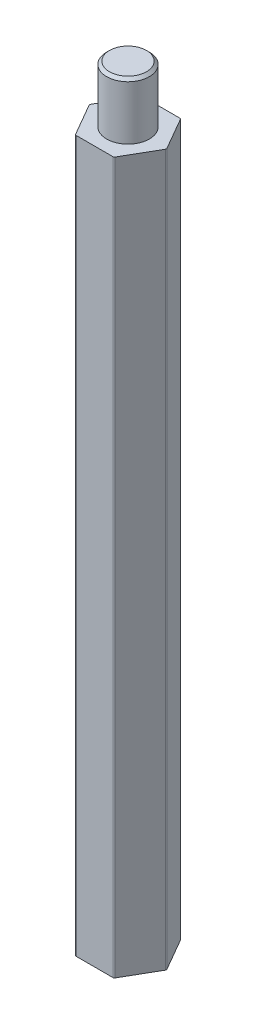
ISO-10303-21;
HEADER;
FILE_DESCRIPTION(('STEP AP214'),'2;1');
FILE_NAME('part.step','',(''),(''),'','','');
FILE_SCHEMA(('AUTOMOTIVE_DESIGN { 1 0 10303 214 1 1 1 1 }'));
ENDSEC;
DATA;
#1=APPLICATION_CONTEXT('core data for automotive mechanical design processes');
#2=APPLICATION_PROTOCOL_DEFINITION('international standard','automotive_design',2000,#1);
#3=PRODUCT_CONTEXT('',#1,'mechanical');
#4=PRODUCT('Part','Part','',(#3));
#5=PRODUCT_RELATED_PRODUCT_CATEGORY('part','',(#4));
#6=PRODUCT_DEFINITION_FORMATION('','',#4);
#7=PRODUCT_DEFINITION_CONTEXT('part definition',#1,'design');
#8=PRODUCT_DEFINITION('design','',#6,#7);
#9=PRODUCT_DEFINITION_SHAPE('','',#8);
#10=(LENGTH_UNIT() NAMED_UNIT(*) SI_UNIT(.MILLI.,.METRE.));
#11=(NAMED_UNIT(*) PLANE_ANGLE_UNIT() SI_UNIT($,.RADIAN.));
#12=(NAMED_UNIT(*) SI_UNIT($,.STERADIAN.) SOLID_ANGLE_UNIT());
#13=UNCERTAINTY_MEASURE_WITH_UNIT(LENGTH_MEASURE(1.E-05),#10,'distance_accuracy_value','');
#14=(GEOMETRIC_REPRESENTATION_CONTEXT(3) GLOBAL_UNCERTAINTY_ASSIGNED_CONTEXT((#13)) GLOBAL_UNIT_ASSIGNED_CONTEXT((#10,
#11,#12)) REPRESENTATION_CONTEXT('',''));
#15=CARTESIAN_POINT('',(0.,0.,0.));
#16=DIRECTION('',(0.,0.,1.));
#17=DIRECTION('',(1.,0.,0.));
#18=AXIS2_PLACEMENT_3D('',#15,#16,#17);
#19=CARTESIAN_POINT('',(1.35677313259565,50.,2.34999999999999));
#20=DIRECTION('',(-0.866025403784442,0.,-0.499999999999995));
#21=DIRECTION('',(-0.499999999999995,0.,0.866025403784442));
#22=AXIS2_PLACEMENT_3D('',#19,#20,#21);
#23=PLANE('',#22);
#24=DIRECTION('',(0.499999999999995,0.,-0.866025403784441));
#25=VECTOR('',#24,1.);
#26=CARTESIAN_POINT('',(1.35677313259565,50.,2.34999999999999));
#27=LINE('',#26,#25);
#28=CARTESIAN_POINT('',(1.38564064605513,50.,2.29999999999999));
#29=VERTEX_POINT('',#28);
#30=CARTESIAN_POINT('',(2.68467875173176,50.,0.0500000000000001));
#31=VERTEX_POINT('',#30);
#32=EDGE_CURVE('E145',#29,#31,#27,.T.);
#33=ORIENTED_EDGE('',*,*,#32,.F.);
#34=DIRECTION('',(0.,-1.,0.));
#35=VECTOR('',#34,1.);
#36=CARTESIAN_POINT('',(1.38564064605513,50.,2.29999999999999));
#37=LINE('',#36,#35);
#38=CARTESIAN_POINT('',(1.38564064605513,0.,2.29999999999999));
#39=VERTEX_POINT('',#38);
#40=EDGE_CURVE('E130',#29,#39,#37,.T.);
#41=ORIENTED_EDGE('',*,*,#40,.T.);
#42=DIRECTION('',(0.499999999999995,0.,-0.866025403784441));
#43=VECTOR('',#42,1.);
#44=CARTESIAN_POINT('',(1.35677313259565,0.,2.34999999999999));
#45=LINE('',#44,#43);
#46=CARTESIAN_POINT('',(2.68467875173176,0.,0.0500000000000001));
#47=VERTEX_POINT('',#46);
#48=EDGE_CURVE('E142',#39,#47,#45,.T.);
#49=ORIENTED_EDGE('',*,*,#48,.T.);
#50=DIRECTION('',(0.,-1.,0.));
#51=VECTOR('',#50,1.);
#52=CARTESIAN_POINT('',(2.68467875173176,50.,0.0499999999999997));
#53=LINE('',#52,#51);
#54=EDGE_CURVE('E147',#47,#31,#53,.F.);
#55=ORIENTED_EDGE('',*,*,#54,.T.);
#56=EDGE_LOOP('',(#33,#41,#49,#55));
#57=FACE_BOUND('',#56,.T.);
#58=ADVANCED_FACE('F36',(#57),#23,.F.);
#59=CARTESIAN_POINT('',(2.71354626519124,50.,0.));
#60=DIRECTION('',(-0.866025403784438,0.,0.500000000000001));
#61=DIRECTION('',(0.500000000000001,0.,0.866025403784438));
#62=AXIS2_PLACEMENT_3D('',#59,#60,#61);
#63=PLANE('',#62);
#64=DIRECTION('',(-0.500000000000001,0.,-0.866025403784438));
#65=VECTOR('',#64,1.);
#66=CARTESIAN_POINT('',(2.71354626519124,0.,0.));
#67=LINE('',#66,#65);
#68=CARTESIAN_POINT('',(2.68467875173176,0.,-0.0499999999999997));
#69=VERTEX_POINT('',#68);
#70=CARTESIAN_POINT('',(1.3856406460551,0.,-2.30000000000001));
#71=VERTEX_POINT('',#70);
#72=EDGE_CURVE('E151',#69,#71,#67,.T.);
#73=ORIENTED_EDGE('',*,*,#72,.T.);
#74=DIRECTION('',(0.,-1.,0.));
#75=VECTOR('',#74,1.);
#76=CARTESIAN_POINT('',(1.3856406460551,50.,-2.30000000000001));
#77=LINE('',#76,#75);
#78=CARTESIAN_POINT('',(1.3856406460551,50.,-2.30000000000001));
#79=VERTEX_POINT('',#78);
#80=EDGE_CURVE('E11',#71,#79,#77,.F.);
#81=ORIENTED_EDGE('',*,*,#80,.T.);
#82=DIRECTION('',(-0.500000000000001,0.,-0.866025403784438));
#83=VECTOR('',#82,1.);
#84=CARTESIAN_POINT('',(2.71354626519124,50.,0.));
#85=LINE('',#84,#83);
#86=CARTESIAN_POINT('',(2.68467875173176,50.,-0.0499999999999997));
#87=VERTEX_POINT('',#86);
#88=EDGE_CURVE('E228',#87,#79,#85,.T.);
#89=ORIENTED_EDGE('',*,*,#88,.F.);
#90=DIRECTION('',(0.,-1.,0.));
#91=VECTOR('',#90,1.);
#92=CARTESIAN_POINT('',(2.68467875173176,50.,-0.0499999999999997));
#93=LINE('',#92,#91);
#94=EDGE_CURVE('E44',#87,#69,#93,.T.);
#95=ORIENTED_EDGE('',*,*,#94,.T.);
#96=EDGE_LOOP('',(#73,#81,#89,#95));
#97=FACE_BOUND('',#96,.T.);
#98=ADVANCED_FACE('F225',(#97),#63,.F.);
#99=CARTESIAN_POINT('',(1.35677313259562,50.,-2.35000000000001));
#100=DIRECTION('',(0.,0.,1.));
#101=DIRECTION('',(1.,0.,0.));
#102=AXIS2_PLACEMENT_3D('',#99,#100,#101);
#103=PLANE('',#102);
#104=DIRECTION('',(-1.,0.,0.));
#105=VECTOR('',#104,1.);
#106=CARTESIAN_POINT('',(1.35677313259562,0.,-2.35000000000001));
#107=LINE('',#106,#105);
#108=CARTESIAN_POINT('',(1.29903810567665,0.,-2.35000000000001));
#109=VERTEX_POINT('',#108);
#110=CARTESIAN_POINT('',(-1.29903810567667,0.,-2.35));
#111=VERTEX_POINT('',#110);
#112=EDGE_CURVE('E155',#109,#111,#107,.T.);
#113=ORIENTED_EDGE('',*,*,#112,.T.);
#114=DIRECTION('',(0.,-1.,0.));
#115=VECTOR('',#114,1.);
#116=CARTESIAN_POINT('',(-1.29903810567667,50.,-2.35));
#117=LINE('',#116,#115);
#118=CARTESIAN_POINT('',(-1.29903810567667,50.,-2.35));
#119=VERTEX_POINT('',#118);
#120=EDGE_CURVE('E220',#111,#119,#117,.F.);
#121=ORIENTED_EDGE('',*,*,#120,.T.);
#122=DIRECTION('',(-1.,0.,0.));
#123=VECTOR('',#122,1.);
#124=CARTESIAN_POINT('',(1.35677313259562,50.,-2.35000000000001));
#125=LINE('',#124,#123);
#126=CARTESIAN_POINT('',(1.29903810567665,50.,-2.35000000000001));
#127=VERTEX_POINT('',#126);
#128=EDGE_CURVE('E241',#127,#119,#125,.T.);
#129=ORIENTED_EDGE('',*,*,#128,.F.);
#130=DIRECTION('',(0.,-1.,0.));
#131=VECTOR('',#130,1.);
#132=CARTESIAN_POINT('',(1.29903810567665,50.,-2.35000000000001));
#133=LINE('',#132,#131);
#134=EDGE_CURVE('E217',#127,#109,#133,.T.);
#135=ORIENTED_EDGE('',*,*,#134,.T.);
#136=EDGE_LOOP('',(#113,#121,#129,#135));
#137=FACE_BOUND('',#136,.T.);
#138=ADVANCED_FACE('F238',(#137),#103,.F.);
#139=CARTESIAN_POINT('',(-1.35677313259563,50.,-2.35));
#140=DIRECTION('',(0.866025403784441,0.,0.499999999999995));
#141=DIRECTION('',(0.499999999999995,0.,-0.866025403784442));
#142=AXIS2_PLACEMENT_3D('',#139,#140,#141);
#143=PLANE('',#142);
#144=DIRECTION('',(-0.499999999999995,0.,0.866025403784441));
#145=VECTOR('',#144,1.);
#146=CARTESIAN_POINT('',(-1.35677313259563,0.,-2.35));
#147=LINE('',#146,#145);
#148=CARTESIAN_POINT('',(-1.38564064605511,0.,-2.3));
#149=VERTEX_POINT('',#148);
#150=CARTESIAN_POINT('',(-2.68467875173176,0.,-0.0499999999999819));
#151=VERTEX_POINT('',#150);
#152=EDGE_CURVE('E166',#149,#151,#147,.T.);
#153=ORIENTED_EDGE('',*,*,#152,.T.);
#154=DIRECTION('',(0.,-1.,0.));
#155=VECTOR('',#154,1.);
#156=CARTESIAN_POINT('',(-2.68467875173176,50.,-0.0499999999999806));
#157=LINE('',#156,#155);
#158=CARTESIAN_POINT('',(-2.68467875173176,50.,-0.0499999999999819));
#159=VERTEX_POINT('',#158);
#160=EDGE_CURVE('E215',#151,#159,#157,.F.);
#161=ORIENTED_EDGE('',*,*,#160,.T.);
#162=DIRECTION('',(-0.499999999999995,0.,0.866025403784441));
#163=VECTOR('',#162,1.);
#164=CARTESIAN_POINT('',(-1.35677313259563,50.,-2.35));
#165=LINE('',#164,#163);
#166=CARTESIAN_POINT('',(-1.38564064605511,50.,-2.3));
#167=VERTEX_POINT('',#166);
#168=EDGE_CURVE('E243',#167,#159,#165,.T.);
#169=ORIENTED_EDGE('',*,*,#168,.F.);
#170=DIRECTION('',(0.,-1.,0.));
#171=VECTOR('',#170,1.);
#172=CARTESIAN_POINT('',(-1.38564064605511,50.,-2.3));
#173=LINE('',#172,#171);
#174=EDGE_CURVE('E212',#167,#149,#173,.T.);
#175=ORIENTED_EDGE('',*,*,#174,.T.);
#176=EDGE_LOOP('',(#153,#161,#169,#175));
#177=FACE_BOUND('',#176,.T.);
#178=ADVANCED_FACE('F266',(#177),#143,.F.);
#179=CARTESIAN_POINT('',(-2.71354626519124,50.,0.));
#180=DIRECTION('',(0.866025403784435,0.,-0.500000000000007));
#181=DIRECTION('',(-0.500000000000007,0.,-0.866025403784435));
#182=AXIS2_PLACEMENT_3D('',#179,#180,#181);
#183=PLANE('',#182);
#184=DIRECTION('',(0.500000000000007,0.,0.866025403784435));
#185=VECTOR('',#184,1.);
#186=CARTESIAN_POINT('',(-2.71354626519124,0.,0.));
#187=LINE('',#186,#185);
#188=CARTESIAN_POINT('',(-2.68467875173176,0.,0.0500000000000189));
#189=VERTEX_POINT('',#188);
#190=CARTESIAN_POINT('',(-1.38564064605508,0.,2.30000000000001));
#191=VERTEX_POINT('',#190);
#192=EDGE_CURVE('E169',#189,#191,#187,.T.);
#193=ORIENTED_EDGE('',*,*,#192,.T.);
#194=DIRECTION('',(0.,-1.,0.));
#195=VECTOR('',#194,1.);
#196=CARTESIAN_POINT('',(-1.38564064605508,50.,2.30000000000001));
#197=LINE('',#196,#195);
#198=CARTESIAN_POINT('',(-1.38564064605508,50.,2.30000000000001));
#199=VERTEX_POINT('',#198);
#200=EDGE_CURVE('E51',#191,#199,#197,.F.);
#201=ORIENTED_EDGE('',*,*,#200,.T.);
#202=DIRECTION('',(0.500000000000007,0.,0.866025403784435));
#203=VECTOR('',#202,1.);
#204=CARTESIAN_POINT('',(-2.71354626519124,50.,0.));
#205=LINE('',#204,#203);
#206=CARTESIAN_POINT('',(-2.68467875173176,50.,0.0500000000000189));
#207=VERTEX_POINT('',#206);
#208=EDGE_CURVE('E245',#207,#199,#205,.T.);
#209=ORIENTED_EDGE('',*,*,#208,.F.);
#210=DIRECTION('',(0.,-1.,0.));
#211=VECTOR('',#210,1.);
#212=CARTESIAN_POINT('',(-2.68467875173176,50.,0.0500000000000189));
#213=LINE('',#212,#211);
#214=EDGE_CURVE('E208',#207,#189,#213,.T.);
#215=ORIENTED_EDGE('',*,*,#214,.T.);
#216=EDGE_LOOP('',(#193,#201,#209,#215));
#217=FACE_BOUND('',#216,.T.);
#218=ADVANCED_FACE('F259',(#217),#183,.F.);
#219=CARTESIAN_POINT('',(-1.3567731325956,50.,2.35000000000001));
#220=DIRECTION('',(0.,0.,-1.));
#221=DIRECTION('',(-1.,0.,0.));
#222=AXIS2_PLACEMENT_3D('',#219,#220,#221);
#223=PLANE('',#222);
#224=DIRECTION('',(1.,0.,0.));
#225=VECTOR('',#224,1.);
#226=CARTESIAN_POINT('',(-1.3567731325956,0.,2.35000000000001));
#227=LINE('',#226,#225);
#228=CARTESIAN_POINT('',(-1.29903810567664,0.,2.35000000000001));
#229=VERTEX_POINT('',#228);
#230=CARTESIAN_POINT('',(1.29903810567669,0.,2.34999999999999));
#231=VERTEX_POINT('',#230);
#232=EDGE_CURVE('E171',#229,#231,#227,.T.);
#233=ORIENTED_EDGE('',*,*,#232,.T.);
#234=DIRECTION('',(0.,-1.,0.));
#235=VECTOR('',#234,1.);
#236=CARTESIAN_POINT('',(1.29903810567669,50.,2.34999999999999));
#237=LINE('',#236,#235);
#238=CARTESIAN_POINT('',(1.29903810567669,50.,2.34999999999999));
#239=VERTEX_POINT('',#238);
#240=EDGE_CURVE('E131',#231,#239,#237,.F.);
#241=ORIENTED_EDGE('',*,*,#240,.T.);
#242=DIRECTION('',(1.,0.,0.));
#243=VECTOR('',#242,1.);
#244=CARTESIAN_POINT('',(-1.3567731325956,50.,2.35000000000001));
#245=LINE('',#244,#243);
#246=CARTESIAN_POINT('',(-1.29903810567664,50.,2.35000000000001));
#247=VERTEX_POINT('',#246);
#248=EDGE_CURVE('E161',#247,#239,#245,.T.);
#249=ORIENTED_EDGE('',*,*,#248,.F.);
#250=DIRECTION('',(0.,-1.,0.));
#251=VECTOR('',#250,1.);
#252=CARTESIAN_POINT('',(-1.29903810567664,50.,2.35000000000001));
#253=LINE('',#252,#251);
#254=EDGE_CURVE('E136',#247,#229,#253,.T.);
#255=ORIENTED_EDGE('',*,*,#254,.T.);
#256=EDGE_LOOP('',(#233,#241,#249,#255));
#257=FACE_BOUND('',#256,.T.);
#258=ADVANCED_FACE('F255',(#257),#223,.F.);
#259=CARTESIAN_POINT('',(0.,50.,0.));
#260=DIRECTION('',(0.,1.,0.));
#261=DIRECTION('',(0.,0.,1.));
#262=AXIS2_PLACEMENT_3D('',#259,#260,#261);
#263=PLANE('',#262);
#264=CARTESIAN_POINT('',(0.,50.,0.));
#265=DIRECTION('',(0.,1.,0.));
#266=DIRECTION('',(0.,0.,1.));
#267=AXIS2_PLACEMENT_3D('',#264,#265,#266);
#268=CIRCLE('',#267,1.5);
#269=CARTESIAN_POINT('',(0.,50.,1.5));
#270=VERTEX_POINT('',#269);
#271=EDGE_CURVE('E152',#270,#270,#268,.T.);
#272=ORIENTED_EDGE('',*,*,#271,.F.);
#273=EDGE_LOOP('',(#272));
#274=FACE_BOUND('',#273,.T.);
#275=ORIENTED_EDGE('',*,*,#248,.T.);
#276=CARTESIAN_POINT('',(1.29903810567669,50.,2.24999999999999));
#277=DIRECTION('',(0.,1.,0.));
#278=DIRECTION('',(0.,0.,1.));
#279=AXIS2_PLACEMENT_3D('',#276,#277,#278);
#280=CIRCLE('',#279,0.1);
#281=EDGE_CURVE('E206',#239,#29,#280,.T.);
#282=ORIENTED_EDGE('',*,*,#281,.T.);
#283=ORIENTED_EDGE('',*,*,#32,.T.);
#284=CARTESIAN_POINT('',(2.59807621135332,50.,0.));
#285=DIRECTION('',(0.,1.,0.));
#286=DIRECTION('',(0.,0.,1.));
#287=AXIS2_PLACEMENT_3D('',#284,#285,#286);
#288=CIRCLE('',#287,0.1);
#289=EDGE_CURVE('E197',#31,#87,#288,.T.);
#290=ORIENTED_EDGE('',*,*,#289,.T.);
#291=ORIENTED_EDGE('',*,*,#88,.T.);
#292=CARTESIAN_POINT('',(1.29903810567665,50.,-2.25000000000001));
#293=DIRECTION('',(0.,1.,0.));
#294=DIRECTION('',(0.,0.,1.));
#295=AXIS2_PLACEMENT_3D('',#292,#293,#294);
#296=CIRCLE('',#295,0.1);
#297=EDGE_CURVE('E199',#79,#127,#296,.T.);
#298=ORIENTED_EDGE('',*,*,#297,.T.);
#299=ORIENTED_EDGE('',*,*,#128,.T.);
#300=CARTESIAN_POINT('',(-1.29903810567667,50.,-2.25));
#301=DIRECTION('',(0.,1.,0.));
#302=DIRECTION('',(0.,0.,1.));
#303=AXIS2_PLACEMENT_3D('',#300,#301,#302);
#304=CIRCLE('',#303,0.1);
#305=EDGE_CURVE('E201',#119,#167,#304,.T.);
#306=ORIENTED_EDGE('',*,*,#305,.T.);
#307=ORIENTED_EDGE('',*,*,#168,.T.);
#308=CARTESIAN_POINT('',(-2.59807621135332,50.,0.));
#309=DIRECTION('',(0.,1.,0.));
#310=DIRECTION('',(0.,0.,1.));
#311=AXIS2_PLACEMENT_3D('',#308,#309,#310);
#312=CIRCLE('',#311,0.1);
#313=EDGE_CURVE('E58',#159,#207,#312,.T.);
#314=ORIENTED_EDGE('',*,*,#313,.T.);
#315=ORIENTED_EDGE('',*,*,#208,.T.);
#316=CARTESIAN_POINT('',(-1.29903810567664,50.,2.25000000000001));
#317=DIRECTION('',(0.,1.,0.));
#318=DIRECTION('',(0.,0.,1.));
#319=AXIS2_PLACEMENT_3D('',#316,#317,#318);
#320=CIRCLE('',#319,0.1);
#321=EDGE_CURVE('E204',#199,#247,#320,.T.);
#322=ORIENTED_EDGE('',*,*,#321,.T.);
#323=EDGE_LOOP('',(#275,#282,#283,#290,#291,#298,#299,#306,#307,#314,#315,#322));
#324=FACE_BOUND('',#323,.T.);
#325=ADVANCED_FACE('F252',(#274,#324),#263,.T.);
#326=CARTESIAN_POINT('',(0.,0.,0.));
#327=DIRECTION('',(0.,1.,0.));
#328=DIRECTION('',(0.,0.,1.));
#329=AXIS2_PLACEMENT_3D('',#326,#327,#328);
#330=PLANE('',#329);
#331=CARTESIAN_POINT('',(0.,0.,0.));
#332=DIRECTION('',(0.,-1.,0.));
#333=DIRECTION('',(0.,0.,-1.));
#334=AXIS2_PLACEMENT_3D('',#331,#332,#333);
#335=CIRCLE('',#334,1.5);
#336=CARTESIAN_POINT('',(0.,0.,-1.5));
#337=VERTEX_POINT('',#336);
#338=EDGE_CURVE('E158',#337,#337,#335,.T.);
#339=ORIENTED_EDGE('',*,*,#338,.F.);
#340=EDGE_LOOP('',(#339));
#341=FACE_BOUND('',#340,.T.);
#342=ORIENTED_EDGE('',*,*,#48,.F.);
#343=CARTESIAN_POINT('',(1.29903810567669,0.,2.24999999999999));
#344=DIRECTION('',(0.,1.,0.));
#345=DIRECTION('',(0.,0.,1.));
#346=AXIS2_PLACEMENT_3D('',#343,#344,#345);
#347=CIRCLE('',#346,0.1);
#348=EDGE_CURVE('E126',#39,#231,#347,.F.);
#349=ORIENTED_EDGE('',*,*,#348,.T.);
#350=ORIENTED_EDGE('',*,*,#232,.F.);
#351=CARTESIAN_POINT('',(-1.29903810567664,0.,2.25000000000001));
#352=DIRECTION('',(0.,1.,0.));
#353=DIRECTION('',(0.,0.,1.));
#354=AXIS2_PLACEMENT_3D('',#351,#352,#353);
#355=CIRCLE('',#354,0.1);
#356=EDGE_CURVE('E137',#229,#191,#355,.F.);
#357=ORIENTED_EDGE('',*,*,#356,.T.);
#358=ORIENTED_EDGE('',*,*,#192,.F.);
#359=CARTESIAN_POINT('',(-2.59807621135332,0.,0.));
#360=DIRECTION('',(0.,1.,0.));
#361=DIRECTION('',(0.,0.,1.));
#362=AXIS2_PLACEMENT_3D('',#359,#360,#361);
#363=CIRCLE('',#362,0.1);
#364=EDGE_CURVE('E191',#189,#151,#363,.F.);
#365=ORIENTED_EDGE('',*,*,#364,.T.);
#366=ORIENTED_EDGE('',*,*,#152,.F.);
#367=CARTESIAN_POINT('',(-1.29903810567667,0.,-2.25));
#368=DIRECTION('',(0.,1.,0.));
#369=DIRECTION('',(0.,0.,1.));
#370=AXIS2_PLACEMENT_3D('',#367,#368,#369);
#371=CIRCLE('',#370,0.1);
#372=EDGE_CURVE('E189',#149,#111,#371,.F.);
#373=ORIENTED_EDGE('',*,*,#372,.T.);
#374=ORIENTED_EDGE('',*,*,#112,.F.);
#375=CARTESIAN_POINT('',(1.29903810567665,0.,-2.25000000000001));
#376=DIRECTION('',(0.,1.,0.));
#377=DIRECTION('',(0.,0.,1.));
#378=AXIS2_PLACEMENT_3D('',#375,#376,#377);
#379=CIRCLE('',#378,0.1);
#380=EDGE_CURVE('E187',#109,#71,#379,.F.);
#381=ORIENTED_EDGE('',*,*,#380,.T.);
#382=ORIENTED_EDGE('',*,*,#72,.F.);
#383=CARTESIAN_POINT('',(2.59807621135332,0.,0.));
#384=DIRECTION('',(0.,1.,0.));
#385=DIRECTION('',(0.,0.,1.));
#386=AXIS2_PLACEMENT_3D('',#383,#384,#385);
#387=CIRCLE('',#386,0.1);
#388=EDGE_CURVE('E146',#69,#47,#387,.F.);
#389=ORIENTED_EDGE('',*,*,#388,.T.);
#390=EDGE_LOOP('',(#342,#349,#350,#357,#358,#365,#366,#373,#374,#381,#382,#389));
#391=FACE_BOUND('',#390,.T.);
#392=ADVANCED_FACE('F149',(#341,#391),#330,.F.);
#393=CARTESIAN_POINT('',(0.,54.,0.));
#394=DIRECTION('',(0.,-1.,0.));
#395=DIRECTION('',(0.,0.,-1.));
#396=AXIS2_PLACEMENT_3D('',#393,#394,#395);
#397=CYLINDRICAL_SURFACE('',#396,1.5);
#398=CARTESIAN_POINT('',(0.,53.8,0.));
#399=DIRECTION('',(0.,1.,0.));
#400=DIRECTION('',(0.,0.,1.));
#401=AXIS2_PLACEMENT_3D('',#398,#399,#400);
#402=CIRCLE('',#401,1.5);
#403=CARTESIAN_POINT('',(0.,53.8,1.5));
#404=VERTEX_POINT('',#403);
#405=EDGE_CURVE('E182',#404,#404,#402,.F.);
#406=ORIENTED_EDGE('',*,*,#405,.T.);
#407=EDGE_LOOP('',(#406));
#408=FACE_BOUND('',#407,.T.);
#409=ORIENTED_EDGE('',*,*,#271,.T.);
#410=EDGE_LOOP('',(#409));
#411=FACE_BOUND('',#410,.T.);
#412=ADVANCED_FACE('F355',(#408,#411),#397,.T.);
#413=CARTESIAN_POINT('',(0.,54.,0.));
#414=DIRECTION('',(0.,1.,0.));
#415=DIRECTION('',(0.,0.,1.));
#416=AXIS2_PLACEMENT_3D('',#413,#414,#415);
#417=PLANE('',#416);
#418=CARTESIAN_POINT('',(0.,54.,0.));
#419=DIRECTION('',(0.,1.,0.));
#420=DIRECTION('',(0.,0.,1.));
#421=AXIS2_PLACEMENT_3D('',#418,#419,#420);
#422=CIRCLE('',#421,1.3);
#423=CARTESIAN_POINT('',(0.,54.,1.3));
#424=VERTEX_POINT('',#423);
#425=EDGE_CURVE('E179',#424,#424,#422,.T.);
#426=ORIENTED_EDGE('',*,*,#425,.T.);
#427=EDGE_LOOP('',(#426));
#428=FACE_BOUND('',#427,.T.);
#429=ADVANCED_FACE('F364',(#428),#417,.T.);
#430=CARTESIAN_POINT('',(0.,4.,0.));
#431=DIRECTION('',(0.,-1.,0.));
#432=DIRECTION('',(0.,0.,-1.));
#433=AXIS2_PLACEMENT_3D('',#430,#431,#432);
#434=CYLINDRICAL_SURFACE('',#433,1.5);
#435=CARTESIAN_POINT('',(0.,3.8,0.));
#436=DIRECTION('',(0.,-1.,0.));
#437=DIRECTION('',(0.,0.,-1.));
#438=AXIS2_PLACEMENT_3D('',#435,#436,#437);
#439=CIRCLE('',#438,1.5);
#440=CARTESIAN_POINT('',(0.,3.8,-1.5));
#441=VERTEX_POINT('',#440);
#442=EDGE_CURVE('E176',#441,#441,#439,.F.);
#443=ORIENTED_EDGE('',*,*,#442,.T.);
#444=EDGE_LOOP('',(#443));
#445=FACE_BOUND('',#444,.T.);
#446=ORIENTED_EDGE('',*,*,#338,.T.);
#447=EDGE_LOOP('',(#446));
#448=FACE_BOUND('',#447,.T.);
#449=ADVANCED_FACE('F408',(#445,#448),#434,.F.);
#450=CARTESIAN_POINT('',(0.,4.,0.));
#451=DIRECTION('',(0.,-1.,0.));
#452=DIRECTION('',(0.,0.,-1.));
#453=AXIS2_PLACEMENT_3D('',#450,#451,#452);
#454=PLANE('',#453);
#455=CARTESIAN_POINT('',(0.,4.,0.));
#456=DIRECTION('',(0.,-1.,0.));
#457=DIRECTION('',(0.,0.,-1.));
#458=AXIS2_PLACEMENT_3D('',#455,#456,#457);
#459=CIRCLE('',#458,1.3);
#460=CARTESIAN_POINT('',(0.,4.,-1.3));
#461=VERTEX_POINT('',#460);
#462=EDGE_CURVE('E173',#461,#461,#459,.T.);
#463=ORIENTED_EDGE('',*,*,#462,.T.);
#464=EDGE_LOOP('',(#463));
#465=FACE_BOUND('',#464,.T.);
#466=ADVANCED_FACE('F290',(#465),#454,.T.);
#467=CARTESIAN_POINT('',(0.,4.,0.));
#468=DIRECTION('',(0.,-1.,0.));
#469=DIRECTION('',(0.,0.,-1.));
#470=AXIS2_PLACEMENT_3D('',#467,#468,#469);
#471=CONICAL_SURFACE('',#470,1.3,0.785398163397451);
#472=ORIENTED_EDGE('',*,*,#442,.F.);
#473=EDGE_LOOP('',(#472));
#474=FACE_BOUND('',#473,.T.);
#475=ORIENTED_EDGE('',*,*,#462,.F.);
#476=EDGE_LOOP('',(#475));
#477=FACE_BOUND('',#476,.T.);
#478=ADVANCED_FACE('F286',(#474,#477),#471,.F.);
#479=CARTESIAN_POINT('',(0.,54.,0.));
#480=DIRECTION('',(0.,-1.,0.));
#481=DIRECTION('',(0.,0.,-1.));
#482=AXIS2_PLACEMENT_3D('',#479,#480,#481);
#483=CONICAL_SURFACE('',#482,1.3,0.785398163397445);
#484=ORIENTED_EDGE('',*,*,#405,.F.);
#485=EDGE_LOOP('',(#484));
#486=FACE_BOUND('',#485,.T.);
#487=ORIENTED_EDGE('',*,*,#425,.F.);
#488=EDGE_LOOP('',(#487));
#489=FACE_BOUND('',#488,.T.);
#490=ADVANCED_FACE('F289',(#486,#489),#483,.T.);
#491=CARTESIAN_POINT('',(1.29903810567669,50.,2.24999999999999));
#492=DIRECTION('',(0.,-1.,0.));
#493=DIRECTION('',(0.,0.,-1.));
#494=AXIS2_PLACEMENT_3D('',#491,#492,#493);
#495=CYLINDRICAL_SURFACE('',#494,0.1);
#496=ORIENTED_EDGE('',*,*,#281,.F.);
#497=ORIENTED_EDGE('',*,*,#240,.F.);
#498=ORIENTED_EDGE('',*,*,#348,.F.);
#499=ORIENTED_EDGE('',*,*,#40,.F.);
#500=EDGE_LOOP('',(#496,#497,#498,#499));
#501=FACE_BOUND('',#500,.T.);
#502=ADVANCED_FACE('F129',(#501),#495,.T.);
#503=CARTESIAN_POINT('',(-1.29903810567664,50.,2.25000000000001));
#504=DIRECTION('',(0.,-1.,0.));
#505=DIRECTION('',(0.,0.,-1.));
#506=AXIS2_PLACEMENT_3D('',#503,#504,#505);
#507=CYLINDRICAL_SURFACE('',#506,0.1);
#508=ORIENTED_EDGE('',*,*,#321,.F.);
#509=ORIENTED_EDGE('',*,*,#200,.F.);
#510=ORIENTED_EDGE('',*,*,#356,.F.);
#511=ORIENTED_EDGE('',*,*,#254,.F.);
#512=EDGE_LOOP('',(#508,#509,#510,#511));
#513=FACE_BOUND('',#512,.T.);
#514=ADVANCED_FACE('F257',(#513),#507,.T.);
#515=CARTESIAN_POINT('',(-2.59807621135332,50.,0.));
#516=DIRECTION('',(0.,-1.,0.));
#517=DIRECTION('',(0.,0.,-1.));
#518=AXIS2_PLACEMENT_3D('',#515,#516,#517);
#519=CYLINDRICAL_SURFACE('',#518,0.1);
#520=ORIENTED_EDGE('',*,*,#313,.F.);
#521=ORIENTED_EDGE('',*,*,#160,.F.);
#522=ORIENTED_EDGE('',*,*,#364,.F.);
#523=ORIENTED_EDGE('',*,*,#214,.F.);
#524=EDGE_LOOP('',(#520,#521,#522,#523));
#525=FACE_BOUND('',#524,.T.);
#526=ADVANCED_FACE('F262',(#525),#519,.T.);
#527=CARTESIAN_POINT('',(-1.29903810567667,50.,-2.25));
#528=DIRECTION('',(0.,-1.,0.));
#529=DIRECTION('',(0.,0.,-1.));
#530=AXIS2_PLACEMENT_3D('',#527,#528,#529);
#531=CYLINDRICAL_SURFACE('',#530,0.1);
#532=ORIENTED_EDGE('',*,*,#305,.F.);
#533=ORIENTED_EDGE('',*,*,#120,.F.);
#534=ORIENTED_EDGE('',*,*,#372,.F.);
#535=ORIENTED_EDGE('',*,*,#174,.F.);
#536=EDGE_LOOP('',(#532,#533,#534,#535));
#537=FACE_BOUND('',#536,.T.);
#538=ADVANCED_FACE('F270',(#537),#531,.T.);
#539=CARTESIAN_POINT('',(1.29903810567665,50.,-2.25000000000001));
#540=DIRECTION('',(0.,-1.,0.));
#541=DIRECTION('',(0.,0.,-1.));
#542=AXIS2_PLACEMENT_3D('',#539,#540,#541);
#543=CYLINDRICAL_SURFACE('',#542,0.1);
#544=ORIENTED_EDGE('',*,*,#297,.F.);
#545=ORIENTED_EDGE('',*,*,#80,.F.);
#546=ORIENTED_EDGE('',*,*,#380,.F.);
#547=ORIENTED_EDGE('',*,*,#134,.F.);
#548=EDGE_LOOP('',(#544,#545,#546,#547));
#549=FACE_BOUND('',#548,.T.);
#550=ADVANCED_FACE('F235',(#549),#543,.T.);
#551=CARTESIAN_POINT('',(2.59807621135332,50.,0.));
#552=DIRECTION('',(0.,-1.,0.));
#553=DIRECTION('',(0.,0.,-1.));
#554=AXIS2_PLACEMENT_3D('',#551,#552,#553);
#555=CYLINDRICAL_SURFACE('',#554,0.1);
#556=ORIENTED_EDGE('',*,*,#289,.F.);
#557=ORIENTED_EDGE('',*,*,#54,.F.);
#558=ORIENTED_EDGE('',*,*,#388,.F.);
#559=ORIENTED_EDGE('',*,*,#94,.F.);
#560=EDGE_LOOP('',(#556,#557,#558,#559));
#561=FACE_BOUND('',#560,.T.);
#562=ADVANCED_FACE('F38',(#561),#555,.T.);
#563=CLOSED_SHELL('',(#58,#98,#138,#178,#218,#258,#325,#392,#412,#429,#449,#466,#478,#490,#502,
#514,#526,#538,#550,#562));
#564=MANIFOLD_SOLID_BREP('B2',#563);
#565=ADVANCED_BREP_SHAPE_REPRESENTATION('',(#18,#564),#14);
#566=SHAPE_DEFINITION_REPRESENTATION(#9,#565);
ENDSEC;
END-ISO-10303-21;
